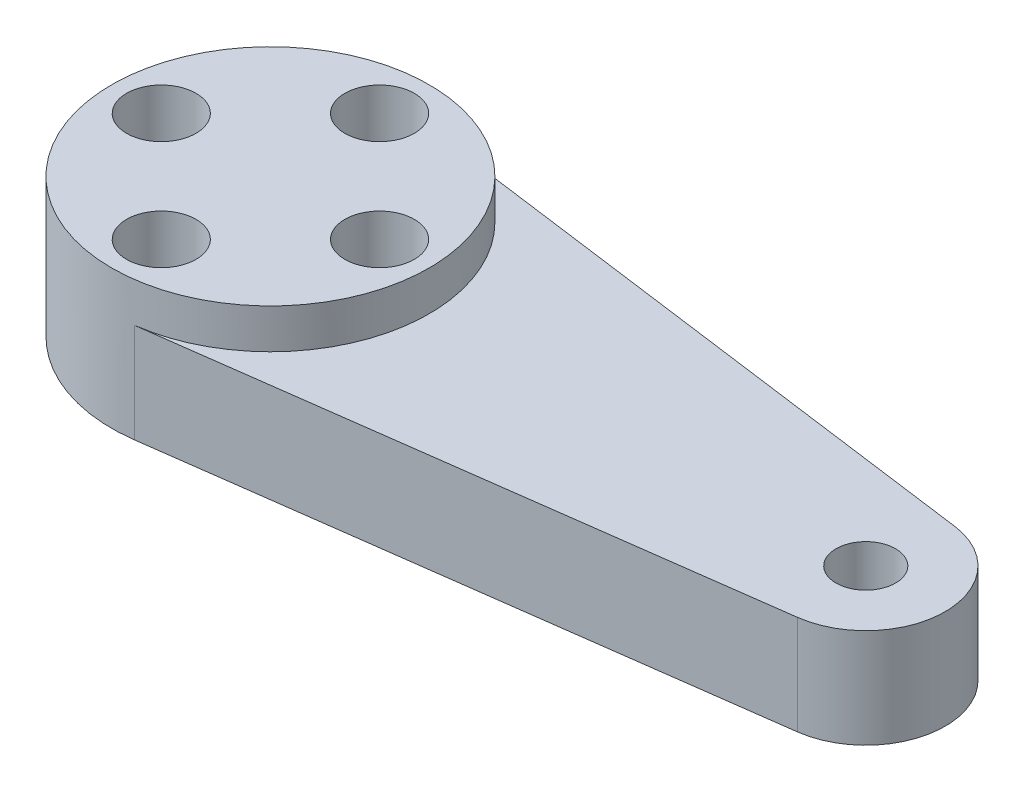
ISO-10303-21;
HEADER;
FILE_DESCRIPTION(('STEP AP214'),'2;1');
FILE_NAME('part.step','',(''),(''),'','','');
FILE_SCHEMA(('AUTOMOTIVE_DESIGN { 1 0 10303 214 1 1 1 1 }'));
ENDSEC;
DATA;
#1=APPLICATION_CONTEXT('core data for automotive mechanical design processes');
#2=APPLICATION_PROTOCOL_DEFINITION('international standard','automotive_design',2000,#1);
#3=PRODUCT_CONTEXT('',#1,'mechanical');
#4=PRODUCT('Part','Part','',(#3));
#5=PRODUCT_RELATED_PRODUCT_CATEGORY('part','',(#4));
#6=PRODUCT_DEFINITION_FORMATION('','',#4);
#7=PRODUCT_DEFINITION_CONTEXT('part definition',#1,'design');
#8=PRODUCT_DEFINITION('design','',#6,#7);
#9=PRODUCT_DEFINITION_SHAPE('','',#8);
#10=(LENGTH_UNIT() NAMED_UNIT(*) SI_UNIT(.MILLI.,.METRE.));
#11=(NAMED_UNIT(*) PLANE_ANGLE_UNIT() SI_UNIT($,.RADIAN.));
#12=(NAMED_UNIT(*) SI_UNIT($,.STERADIAN.) SOLID_ANGLE_UNIT());
#13=UNCERTAINTY_MEASURE_WITH_UNIT(LENGTH_MEASURE(1.E-05),#10,'distance_accuracy_value','');
#14=(GEOMETRIC_REPRESENTATION_CONTEXT(3) GLOBAL_UNCERTAINTY_ASSIGNED_CONTEXT((#13)) GLOBAL_UNIT_ASSIGNED_CONTEXT((#10,
#11,#12)) REPRESENTATION_CONTEXT('',''));
#15=CARTESIAN_POINT('',(0.,0.,0.));
#16=DIRECTION('',(0.,0.,1.));
#17=DIRECTION('',(1.,0.,0.));
#18=AXIS2_PLACEMENT_3D('',#15,#16,#17);
#19=CARTESIAN_POINT('',(0.,5.,0.));
#20=DIRECTION('',(0.,1.,0.));
#21=DIRECTION('',(0.,0.,1.));
#22=AXIS2_PLACEMENT_3D('',#19,#20,#21);
#23=PLANE('',#22);
#24=CARTESIAN_POINT('',(0.,5.,0.));
#25=DIRECTION('',(0.,1.,0.));
#26=DIRECTION('',(0.,0.,1.));
#27=AXIS2_PLACEMENT_3D('',#24,#25,#26);
#28=CIRCLE('',#27,8.);
#29=CARTESIAN_POINT('',(1.06666666666667,5.,7.92856999856987));
#30=VERTEX_POINT('',#29);
#31=CARTESIAN_POINT('',(1.06666666666666,5.,-7.92856999856987));
#32=VERTEX_POINT('',#31);
#33=EDGE_CURVE('E89',#30,#32,#28,.T.);
#34=ORIENTED_EDGE('',*,*,#33,.F.);
#35=DIRECTION('',(0.991071249821234,0.,-0.133333333333333));
#36=VECTOR('',#35,1.);
#37=CARTESIAN_POINT('',(1.06666666666667,5.,7.92856999856987));
#38=LINE('',#37,#36);
#39=CARTESIAN_POINT('',(30.5333333333333,5.,3.96428499928494));
#40=VERTEX_POINT('',#39);
#41=EDGE_CURVE('E81',#30,#40,#38,.T.);
#42=ORIENTED_EDGE('',*,*,#41,.T.);
#43=CARTESIAN_POINT('',(30.,5.,0.));
#44=DIRECTION('',(0.,1.,0.));
#45=DIRECTION('',(0.,0.,1.));
#46=AXIS2_PLACEMENT_3D('',#43,#44,#45);
#47=CIRCLE('',#46,4.);
#48=CARTESIAN_POINT('',(30.5333333333333,5.,-3.96428499928494));
#49=VERTEX_POINT('',#48);
#50=EDGE_CURVE('E95',#40,#49,#47,.T.);
#51=ORIENTED_EDGE('',*,*,#50,.T.);
#52=DIRECTION('',(-0.991071249821234,0.,-0.133333333333333));
#53=VECTOR('',#52,1.);
#54=CARTESIAN_POINT('',(1.06666666666666,5.,-7.92856999856987));
#55=LINE('',#54,#53);
#56=EDGE_CURVE('E54',#49,#32,#55,.T.);
#57=ORIENTED_EDGE('',*,*,#56,.T.);
#58=EDGE_LOOP('',(#34,#42,#51,#57));
#59=FACE_BOUND('',#58,.T.);
#60=CARTESIAN_POINT('',(30.,5.,0.));
#61=DIRECTION('',(0.,1.,0.));
#62=DIRECTION('',(0.,0.,1.));
#63=AXIS2_PLACEMENT_3D('',#60,#61,#62);
#64=CIRCLE('',#63,1.5);
#65=CARTESIAN_POINT('',(30.,5.,1.5));
#66=VERTEX_POINT('',#65);
#67=EDGE_CURVE('E120',#66,#66,#64,.T.);
#68=ORIENTED_EDGE('',*,*,#67,.F.);
#69=EDGE_LOOP('',(#68));
#70=FACE_BOUND('',#69,.T.);
#71=ADVANCED_FACE('F37',(#59,#70),#23,.T.);
#72=CARTESIAN_POINT('',(0.,0.,0.));
#73=DIRECTION('',(0.,1.,0.));
#74=DIRECTION('',(0.,0.,1.));
#75=AXIS2_PLACEMENT_3D('',#72,#73,#74);
#76=PLANE('',#75);
#77=CARTESIAN_POINT('',(0.,0.,0.));
#78=DIRECTION('',(0.,1.,0.));
#79=DIRECTION('',(0.,0.,1.));
#80=AXIS2_PLACEMENT_3D('',#77,#78,#79);
#81=CIRCLE('',#80,8.);
#82=CARTESIAN_POINT('',(1.06666666666666,0.,-7.92856999856987));
#83=VERTEX_POINT('',#82);
#84=CARTESIAN_POINT('',(1.06666666666667,0.,7.92856999856987));
#85=VERTEX_POINT('',#84);
#86=EDGE_CURVE('E91',#83,#85,#81,.T.);
#87=ORIENTED_EDGE('',*,*,#86,.F.);
#88=DIRECTION('',(-0.991071249821234,0.,-0.133333333333333));
#89=VECTOR('',#88,1.);
#90=CARTESIAN_POINT('',(1.06666666666666,0.,-7.92856999856987));
#91=LINE('',#90,#89);
#92=CARTESIAN_POINT('',(30.5333333333333,0.,-3.96428499928494));
#93=VERTEX_POINT('',#92);
#94=EDGE_CURVE('E77',#93,#83,#91,.T.);
#95=ORIENTED_EDGE('',*,*,#94,.F.);
#96=CARTESIAN_POINT('',(30.,0.,0.));
#97=DIRECTION('',(0.,1.,0.));
#98=DIRECTION('',(0.,0.,1.));
#99=AXIS2_PLACEMENT_3D('',#96,#97,#98);
#100=CIRCLE('',#99,4.);
#101=CARTESIAN_POINT('',(30.5333333333333,0.,3.96428499928494));
#102=VERTEX_POINT('',#101);
#103=EDGE_CURVE('E72',#102,#93,#100,.T.);
#104=ORIENTED_EDGE('',*,*,#103,.F.);
#105=DIRECTION('',(0.991071249821234,0.,-0.133333333333333));
#106=VECTOR('',#105,1.);
#107=CARTESIAN_POINT('',(1.06666666666667,0.,7.92856999856987));
#108=LINE('',#107,#106);
#109=EDGE_CURVE('E129',#85,#102,#108,.T.);
#110=ORIENTED_EDGE('',*,*,#109,.F.);
#111=EDGE_LOOP('',(#87,#95,#104,#110));
#112=FACE_BOUND('',#111,.T.);
#113=CARTESIAN_POINT('',(30.,0.,0.));
#114=DIRECTION('',(0.,1.,0.));
#115=DIRECTION('',(0.,0.,1.));
#116=AXIS2_PLACEMENT_3D('',#113,#114,#115);
#117=CIRCLE('',#116,1.5);
#118=CARTESIAN_POINT('',(30.,0.,1.5));
#119=VERTEX_POINT('',#118);
#120=EDGE_CURVE('E119',#119,#119,#117,.T.);
#121=ORIENTED_EDGE('',*,*,#120,.T.);
#122=EDGE_LOOP('',(#121));
#123=FACE_BOUND('',#122,.T.);
#124=CARTESIAN_POINT('',(-5.5,0.,0.));
#125=DIRECTION('',(0.,1.,0.));
#126=DIRECTION('',(0.,0.,1.));
#127=AXIS2_PLACEMENT_3D('',#124,#125,#126);
#128=CIRCLE('',#127,1.75);
#129=CARTESIAN_POINT('',(-5.5,0.,1.75));
#130=VERTEX_POINT('',#129);
#131=EDGE_CURVE('E116',#130,#130,#128,.T.);
#132=ORIENTED_EDGE('',*,*,#131,.T.);
#133=EDGE_LOOP('',(#132));
#134=FACE_BOUND('',#133,.T.);
#135=CARTESIAN_POINT('',(0.,0.,-5.5));
#136=DIRECTION('',(0.,1.,0.));
#137=DIRECTION('',(0.,0.,1.));
#138=AXIS2_PLACEMENT_3D('',#135,#136,#137);
#139=CIRCLE('',#138,1.75);
#140=CARTESIAN_POINT('',(0.,0.,-3.75));
#141=VERTEX_POINT('',#140);
#142=EDGE_CURVE('E113',#141,#141,#139,.T.);
#143=ORIENTED_EDGE('',*,*,#142,.T.);
#144=EDGE_LOOP('',(#143));
#145=FACE_BOUND('',#144,.T.);
#146=CARTESIAN_POINT('',(5.5,0.,0.));
#147=DIRECTION('',(0.,1.,0.));
#148=DIRECTION('',(0.,0.,1.));
#149=AXIS2_PLACEMENT_3D('',#146,#147,#148);
#150=CIRCLE('',#149,1.75);
#151=CARTESIAN_POINT('',(5.5,0.,1.75000000000004));
#152=VERTEX_POINT('',#151);
#153=EDGE_CURVE('E110',#152,#152,#150,.T.);
#154=ORIENTED_EDGE('',*,*,#153,.T.);
#155=EDGE_LOOP('',(#154));
#156=FACE_BOUND('',#155,.T.);
#157=CARTESIAN_POINT('',(0.,0.,5.5));
#158=DIRECTION('',(0.,1.,0.));
#159=DIRECTION('',(0.,0.,1.));
#160=AXIS2_PLACEMENT_3D('',#157,#158,#159);
#161=CIRCLE('',#160,1.75);
#162=CARTESIAN_POINT('',(0.,0.,7.25));
#163=VERTEX_POINT('',#162);
#164=EDGE_CURVE('E102',#163,#163,#161,.T.);
#165=ORIENTED_EDGE('',*,*,#164,.T.);
#166=EDGE_LOOP('',(#165));
#167=FACE_BOUND('',#166,.T.);
#168=ADVANCED_FACE('F137',(#112,#123,#134,#145,#156,#167),#76,.F.);
#169=CARTESIAN_POINT('',(0.,5.,0.));
#170=DIRECTION('',(0.,-1.,0.));
#171=DIRECTION('',(0.,0.,-1.));
#172=AXIS2_PLACEMENT_3D('',#169,#170,#171);
#173=CYLINDRICAL_SURFACE('',#172,8.);
#174=ORIENTED_EDGE('',*,*,#86,.T.);
#175=DIRECTION('',(0.,-1.,0.));
#176=VECTOR('',#175,1.);
#177=CARTESIAN_POINT('',(1.06666666666667,5.,7.92856999856987));
#178=LINE('',#177,#176);
#179=EDGE_CURVE('E11',#30,#85,#178,.T.);
#180=ORIENTED_EDGE('',*,*,#179,.F.);
#181=ORIENTED_EDGE('',*,*,#33,.T.);
#182=DIRECTION('',(0.,-1.,0.));
#183=VECTOR('',#182,1.);
#184=CARTESIAN_POINT('',(1.06666666666666,5.,-7.92856999856987));
#185=LINE('',#184,#183);
#186=EDGE_CURVE('E127',#32,#83,#185,.T.);
#187=ORIENTED_EDGE('',*,*,#186,.T.);
#188=EDGE_LOOP('',(#174,#180,#181,#187));
#189=FACE_BOUND('',#188,.T.);
#190=CARTESIAN_POINT('',(0.,7.,0.));
#191=DIRECTION('',(0.,1.,0.));
#192=DIRECTION('',(0.,0.,1.));
#193=AXIS2_PLACEMENT_3D('',#190,#191,#192);
#194=CIRCLE('',#193,8.);
#195=CARTESIAN_POINT('',(0.,7.,8.));
#196=VERTEX_POINT('',#195);
#197=EDGE_CURVE('E98',#196,#196,#194,.T.);
#198=ORIENTED_EDGE('',*,*,#197,.F.);
#199=EDGE_LOOP('',(#198));
#200=FACE_BOUND('',#199,.T.);
#201=ADVANCED_FACE('F39',(#189,#200),#173,.T.);
#202=CARTESIAN_POINT('',(1.06666666666667,5.,7.92856999856987));
#203=DIRECTION('',(-0.133333333333333,0.,-0.991071249821234));
#204=DIRECTION('',(-0.991071249821234,0.,0.133333333333333));
#205=AXIS2_PLACEMENT_3D('',#202,#203,#204);
#206=PLANE('',#205);
#207=ORIENTED_EDGE('',*,*,#109,.T.);
#208=DIRECTION('',(0.,-1.,0.));
#209=VECTOR('',#208,1.);
#210=CARTESIAN_POINT('',(30.5333333333333,5.,3.96428499928494));
#211=LINE('',#210,#209);
#212=EDGE_CURVE('E46',#40,#102,#211,.T.);
#213=ORIENTED_EDGE('',*,*,#212,.F.);
#214=ORIENTED_EDGE('',*,*,#41,.F.);
#215=ORIENTED_EDGE('',*,*,#179,.T.);
#216=EDGE_LOOP('',(#207,#213,#214,#215));
#217=FACE_BOUND('',#216,.T.);
#218=ADVANCED_FACE('F93',(#217),#206,.F.);
#219=CARTESIAN_POINT('',(30.,5.,0.));
#220=DIRECTION('',(0.,-1.,0.));
#221=DIRECTION('',(0.,0.,-1.));
#222=AXIS2_PLACEMENT_3D('',#219,#220,#221);
#223=CYLINDRICAL_SURFACE('',#222,4.);
#224=ORIENTED_EDGE('',*,*,#103,.T.);
#225=DIRECTION('',(0.,-1.,0.));
#226=VECTOR('',#225,1.);
#227=CARTESIAN_POINT('',(30.5333333333333,5.,-3.96428499928494));
#228=LINE('',#227,#226);
#229=EDGE_CURVE('E134',#49,#93,#228,.T.);
#230=ORIENTED_EDGE('',*,*,#229,.F.);
#231=ORIENTED_EDGE('',*,*,#50,.F.);
#232=ORIENTED_EDGE('',*,*,#212,.T.);
#233=EDGE_LOOP('',(#224,#230,#231,#232));
#234=FACE_BOUND('',#233,.T.);
#235=ADVANCED_FACE('F135',(#234),#223,.T.);
#236=CARTESIAN_POINT('',(1.06666666666666,5.,-7.92856999856987));
#237=DIRECTION('',(-0.133333333333333,0.,0.991071249821234));
#238=DIRECTION('',(0.991071249821234,0.,0.133333333333333));
#239=AXIS2_PLACEMENT_3D('',#236,#237,#238);
#240=PLANE('',#239);
#241=ORIENTED_EDGE('',*,*,#94,.T.);
#242=ORIENTED_EDGE('',*,*,#186,.F.);
#243=ORIENTED_EDGE('',*,*,#56,.F.);
#244=ORIENTED_EDGE('',*,*,#229,.T.);
#245=EDGE_LOOP('',(#241,#242,#243,#244));
#246=FACE_BOUND('',#245,.T.);
#247=ADVANCED_FACE('F186',(#246),#240,.F.);
#248=CARTESIAN_POINT('',(30.,5.,0.));
#249=DIRECTION('',(0.,-1.,0.));
#250=DIRECTION('',(0.,0.,-1.));
#251=AXIS2_PLACEMENT_3D('',#248,#249,#250);
#252=CYLINDRICAL_SURFACE('',#251,1.5);
#253=ORIENTED_EDGE('',*,*,#67,.T.);
#254=EDGE_LOOP('',(#253));
#255=FACE_BOUND('',#254,.T.);
#256=ORIENTED_EDGE('',*,*,#120,.F.);
#257=EDGE_LOOP('',(#256));
#258=FACE_BOUND('',#257,.T.);
#259=ADVANCED_FACE('F183',(#255,#258),#252,.F.);
#260=CARTESIAN_POINT('',(-5.5,5.,0.));
#261=DIRECTION('',(0.,-1.,0.));
#262=DIRECTION('',(0.,0.,-1.));
#263=AXIS2_PLACEMENT_3D('',#260,#261,#262);
#264=CYLINDRICAL_SURFACE('',#263,1.75);
#265=ORIENTED_EDGE('',*,*,#131,.F.);
#266=EDGE_LOOP('',(#265));
#267=FACE_BOUND('',#266,.T.);
#268=CARTESIAN_POINT('',(-5.5,7.,0.));
#269=DIRECTION('',(0.,1.,0.));
#270=DIRECTION('',(0.,0.,1.));
#271=AXIS2_PLACEMENT_3D('',#268,#269,#270);
#272=CIRCLE('',#271,1.75);
#273=CARTESIAN_POINT('',(-5.5,7.,1.75));
#274=VERTEX_POINT('',#273);
#275=EDGE_CURVE('E99',#274,#274,#272,.T.);
#276=ORIENTED_EDGE('',*,*,#275,.T.);
#277=EDGE_LOOP('',(#276));
#278=FACE_BOUND('',#277,.T.);
#279=ADVANCED_FACE('F225',(#267,#278),#264,.F.);
#280=CARTESIAN_POINT('',(0.,5.,-5.5));
#281=DIRECTION('',(0.,-1.,0.));
#282=DIRECTION('',(0.,0.,-1.));
#283=AXIS2_PLACEMENT_3D('',#280,#281,#282);
#284=CYLINDRICAL_SURFACE('',#283,1.75);
#285=ORIENTED_EDGE('',*,*,#142,.F.);
#286=EDGE_LOOP('',(#285));
#287=FACE_BOUND('',#286,.T.);
#288=CARTESIAN_POINT('',(0.,7.,-5.5));
#289=DIRECTION('',(0.,1.,0.));
#290=DIRECTION('',(0.,0.,1.));
#291=AXIS2_PLACEMENT_3D('',#288,#289,#290);
#292=CIRCLE('',#291,1.75);
#293=CARTESIAN_POINT('',(0.,7.,-3.75));
#294=VERTEX_POINT('',#293);
#295=EDGE_CURVE('E163',#294,#294,#292,.T.);
#296=ORIENTED_EDGE('',*,*,#295,.T.);
#297=EDGE_LOOP('',(#296));
#298=FACE_BOUND('',#297,.T.);
#299=ADVANCED_FACE('F169',(#287,#298),#284,.F.);
#300=CARTESIAN_POINT('',(5.5,5.,0.));
#301=DIRECTION('',(0.,-1.,0.));
#302=DIRECTION('',(0.,0.,-1.));
#303=AXIS2_PLACEMENT_3D('',#300,#301,#302);
#304=CYLINDRICAL_SURFACE('',#303,1.75);
#305=ORIENTED_EDGE('',*,*,#153,.F.);
#306=EDGE_LOOP('',(#305));
#307=FACE_BOUND('',#306,.T.);
#308=CARTESIAN_POINT('',(5.5,7.,0.));
#309=DIRECTION('',(0.,1.,0.));
#310=DIRECTION('',(0.,0.,1.));
#311=AXIS2_PLACEMENT_3D('',#308,#309,#310);
#312=CIRCLE('',#311,1.75);
#313=CARTESIAN_POINT('',(5.5,7.,1.75000000000004));
#314=VERTEX_POINT('',#313);
#315=EDGE_CURVE('E160',#314,#314,#312,.T.);
#316=ORIENTED_EDGE('',*,*,#315,.T.);
#317=EDGE_LOOP('',(#316));
#318=FACE_BOUND('',#317,.T.);
#319=ADVANCED_FACE('F155',(#307,#318),#304,.F.);
#320=CARTESIAN_POINT('',(0.,5.,5.5));
#321=DIRECTION('',(0.,-1.,0.));
#322=DIRECTION('',(0.,0.,-1.));
#323=AXIS2_PLACEMENT_3D('',#320,#321,#322);
#324=CYLINDRICAL_SURFACE('',#323,1.75);
#325=ORIENTED_EDGE('',*,*,#164,.F.);
#326=EDGE_LOOP('',(#325));
#327=FACE_BOUND('',#326,.T.);
#328=CARTESIAN_POINT('',(0.,7.,5.5));
#329=DIRECTION('',(0.,1.,0.));
#330=DIRECTION('',(0.,0.,1.));
#331=AXIS2_PLACEMENT_3D('',#328,#329,#330);
#332=CIRCLE('',#331,1.75);
#333=CARTESIAN_POINT('',(0.,7.,7.25));
#334=VERTEX_POINT('',#333);
#335=EDGE_CURVE('E105',#334,#334,#332,.T.);
#336=ORIENTED_EDGE('',*,*,#335,.T.);
#337=EDGE_LOOP('',(#336));
#338=FACE_BOUND('',#337,.T.);
#339=ADVANCED_FACE('F151',(#327,#338),#324,.F.);
#340=CARTESIAN_POINT('',(0.,7.,0.));
#341=DIRECTION('',(0.,1.,0.));
#342=DIRECTION('',(0.,0.,1.));
#343=AXIS2_PLACEMENT_3D('',#340,#341,#342);
#344=PLANE('',#343);
#345=ORIENTED_EDGE('',*,*,#315,.F.);
#346=EDGE_LOOP('',(#345));
#347=FACE_BOUND('',#346,.T.);
#348=ORIENTED_EDGE('',*,*,#275,.F.);
#349=EDGE_LOOP('',(#348));
#350=FACE_BOUND('',#349,.T.);
#351=ORIENTED_EDGE('',*,*,#197,.T.);
#352=EDGE_LOOP('',(#351));
#353=FACE_BOUND('',#352,.T.);
#354=ORIENTED_EDGE('',*,*,#335,.F.);
#355=EDGE_LOOP('',(#354));
#356=FACE_BOUND('',#355,.T.);
#357=ORIENTED_EDGE('',*,*,#295,.F.);
#358=EDGE_LOOP('',(#357));
#359=FACE_BOUND('',#358,.T.);
#360=ADVANCED_FACE('F154',(#347,#350,#353,#356,#359),#344,.T.);
#361=CLOSED_SHELL('',(#71,#168,#201,#218,#235,#247,#259,#279,#299,#319,#339,#360));
#362=MANIFOLD_SOLID_BREP('B2',#361);
#363=ADVANCED_BREP_SHAPE_REPRESENTATION('',(#18,#362),#14);
#364=SHAPE_DEFINITION_REPRESENTATION(#9,#363);
ENDSEC;
END-ISO-10303-21;
